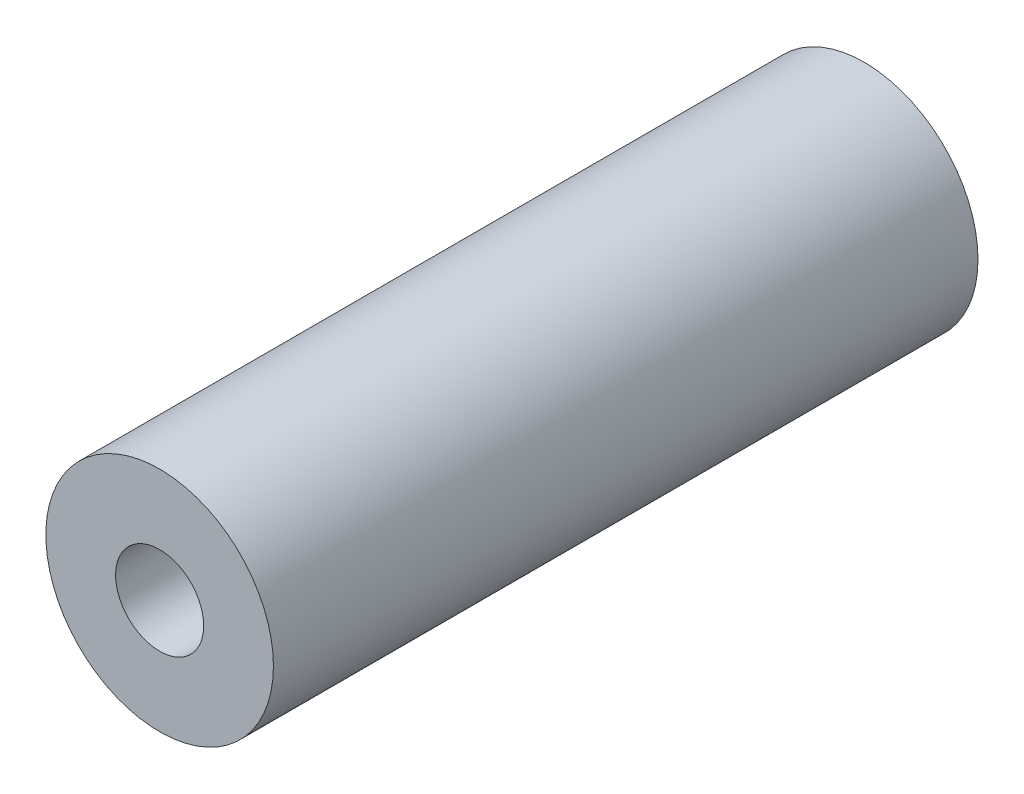
ISO-10303-21;
HEADER;
FILE_DESCRIPTION(('STEP AP214'),'2;1');
FILE_NAME('part.step','',(''),(''),'','','');
FILE_SCHEMA(('AUTOMOTIVE_DESIGN { 1 0 10303 214 1 1 1 1 }'));
ENDSEC;
DATA;
#1=APPLICATION_CONTEXT('core data for automotive mechanical design processes');
#2=APPLICATION_PROTOCOL_DEFINITION('international standard','automotive_design',2000,#1);
#3=PRODUCT_CONTEXT('',#1,'mechanical');
#4=PRODUCT('Part','Part','',(#3));
#5=PRODUCT_RELATED_PRODUCT_CATEGORY('part','',(#4));
#6=PRODUCT_DEFINITION_FORMATION('','',#4);
#7=PRODUCT_DEFINITION_CONTEXT('part definition',#1,'design');
#8=PRODUCT_DEFINITION('design','',#6,#7);
#9=PRODUCT_DEFINITION_SHAPE('','',#8);
#10=(LENGTH_UNIT() NAMED_UNIT(*) SI_UNIT(.MILLI.,.METRE.));
#11=(NAMED_UNIT(*) PLANE_ANGLE_UNIT() SI_UNIT($,.RADIAN.));
#12=(NAMED_UNIT(*) SI_UNIT($,.STERADIAN.) SOLID_ANGLE_UNIT());
#13=UNCERTAINTY_MEASURE_WITH_UNIT(LENGTH_MEASURE(1.E-05),#10,'distance_accuracy_value','');
#14=(GEOMETRIC_REPRESENTATION_CONTEXT(3) GLOBAL_UNCERTAINTY_ASSIGNED_CONTEXT((#13)) GLOBAL_UNIT_ASSIGNED_CONTEXT((#10,
#11,#12)) REPRESENTATION_CONTEXT('',''));
#15=CARTESIAN_POINT('',(0.,0.,0.));
#16=DIRECTION('',(0.,0.,1.));
#17=DIRECTION('',(1.,0.,0.));
#18=AXIS2_PLACEMENT_3D('',#15,#16,#17);
#19=CARTESIAN_POINT('',(-492.127121378298,1432.78731013692,0.));
#20=DIRECTION('',(0.,0.,1.));
#21=DIRECTION('',(1.,0.,0.));
#22=AXIS2_PLACEMENT_3D('',#19,#20,#21);
#23=PLANE('',#22);
#24=CARTESIAN_POINT('',(-492.127121378298,1432.78731013692,0.));
#25=DIRECTION('',(0.,0.,1.));
#26=DIRECTION('',(1.,0.,0.));
#27=AXIS2_PLACEMENT_3D('',#24,#25,#26);
#28=CIRCLE('',#27,16.4084);
#29=CARTESIAN_POINT('',(-475.718721378298,1432.78731013692,0.));
#30=VERTEX_POINT('',#29);
#31=EDGE_CURVE('E53',#30,#30,#28,.T.);
#32=ORIENTED_EDGE('',*,*,#31,.F.);
#33=EDGE_LOOP('',(#32));
#34=FACE_BOUND('',#33,.T.);
#35=CARTESIAN_POINT('',(-492.127121378298,1432.78731013692,0.));
#36=DIRECTION('',(0.,0.,1.));
#37=DIRECTION('',(1.,0.,0.));
#38=AXIS2_PLACEMENT_3D('',#35,#36,#37);
#39=CIRCLE('',#38,6.35000000000008);
#40=CARTESIAN_POINT('',(-485.777121378298,1432.78731013692,0.));
#41=VERTEX_POINT('',#40);
#42=EDGE_CURVE('E66',#41,#41,#39,.T.);
#43=ORIENTED_EDGE('',*,*,#42,.T.);
#44=EDGE_LOOP('',(#43));
#45=FACE_BOUND('',#44,.T.);
#46=ADVANCED_FACE('F46',(#34,#45),#23,.F.);
#47=CARTESIAN_POINT('',(-492.127121378298,2028.05100619533,101.599999999999));
#48=DIRECTION('',(0.,0.,1.));
#49=DIRECTION('',(1.,0.,0.));
#50=AXIS2_PLACEMENT_3D('',#47,#48,#49);
#51=PLANE('',#50);
#52=CARTESIAN_POINT('',(-492.127121378298,1432.78731013692,101.599999999999));
#53=DIRECTION('',(0.,0.,1.));
#54=DIRECTION('',(1.,0.,0.));
#55=AXIS2_PLACEMENT_3D('',#52,#53,#54);
#56=CIRCLE('',#55,16.4084);
#57=CARTESIAN_POINT('',(-475.718721378298,1432.78731013692,101.599999999999));
#58=VERTEX_POINT('',#57);
#59=EDGE_CURVE('E12',#58,#58,#56,.T.);
#60=ORIENTED_EDGE('',*,*,#59,.T.);
#61=EDGE_LOOP('',(#60));
#62=FACE_BOUND('',#61,.T.);
#63=CARTESIAN_POINT('',(-492.127121378298,1432.78731013692,101.599999999999));
#64=DIRECTION('',(0.,0.,1.));
#65=DIRECTION('',(1.,0.,0.));
#66=AXIS2_PLACEMENT_3D('',#63,#64,#65);
#67=CIRCLE('',#66,6.35000000000008);
#68=CARTESIAN_POINT('',(-485.777121378298,1432.78731013692,101.599999999999));
#69=VERTEX_POINT('',#68);
#70=EDGE_CURVE('E61',#69,#69,#67,.T.);
#71=ORIENTED_EDGE('',*,*,#70,.F.);
#72=EDGE_LOOP('',(#71));
#73=FACE_BOUND('',#72,.T.);
#74=ADVANCED_FACE('F48',(#62,#73),#51,.T.);
#75=CARTESIAN_POINT('',(-492.127121378298,1432.78731013692,148.009963633685));
#76=DIRECTION('',(0.,0.,-1.));
#77=DIRECTION('',(-1.,0.,0.));
#78=AXIS2_PLACEMENT_3D('',#75,#76,#77);
#79=CYLINDRICAL_SURFACE('',#78,16.4084);
#80=ORIENTED_EDGE('',*,*,#31,.T.);
#81=EDGE_LOOP('',(#80));
#82=FACE_BOUND('',#81,.T.);
#83=ORIENTED_EDGE('',*,*,#59,.F.);
#84=EDGE_LOOP('',(#83));
#85=FACE_BOUND('',#84,.T.);
#86=ADVANCED_FACE('F85',(#82,#85),#79,.T.);
#87=CARTESIAN_POINT('',(-492.127121378298,1445.38571013692,91.4399999999993));
#88=DIRECTION('',(0.,0.,-1.));
#89=DIRECTION('',(-1.,0.,0.));
#90=AXIS2_PLACEMENT_3D('',#87,#88,#89);
#91=PLANE('',#90);
#92=CARTESIAN_POINT('',(-492.127121378298,1432.78731013692,91.4399999999992));
#93=DIRECTION('',(0.,0.,1.));
#94=DIRECTION('',(1.,0.,0.));
#95=AXIS2_PLACEMENT_3D('',#92,#93,#94);
#96=CIRCLE('',#95,6.35000000000008);
#97=CARTESIAN_POINT('',(-485.777121378298,1432.78731013692,91.4399999999992));
#98=VERTEX_POINT('',#97);
#99=EDGE_CURVE('E57',#98,#98,#96,.T.);
#100=ORIENTED_EDGE('',*,*,#99,.T.);
#101=EDGE_LOOP('',(#100));
#102=FACE_BOUND('',#101,.T.);
#103=CARTESIAN_POINT('',(-492.127121378298,1432.78731013692,91.4399999999994));
#104=DIRECTION('',(0.,0.,1.));
#105=DIRECTION('',(1.,0.,0.));
#106=AXIS2_PLACEMENT_3D('',#103,#104,#105);
#107=CIRCLE('',#106,12.5983999999999);
#108=CARTESIAN_POINT('',(-479.528721378298,1432.78731013692,91.4399999999994));
#109=VERTEX_POINT('',#108);
#110=EDGE_CURVE('E75',#109,#109,#107,.T.);
#111=ORIENTED_EDGE('',*,*,#110,.F.);
#112=EDGE_LOOP('',(#111));
#113=FACE_BOUND('',#112,.T.);
#114=ADVANCED_FACE('F82',(#102,#113),#91,.T.);
#115=CARTESIAN_POINT('',(-492.127121378298,1432.78731013692,101.599999999999));
#116=DIRECTION('',(0.,0.,1.));
#117=DIRECTION('',(1.,0.,0.));
#118=AXIS2_PLACEMENT_3D('',#115,#116,#117);
#119=CYLINDRICAL_SURFACE('',#118,6.35000000000008);
#120=ORIENTED_EDGE('',*,*,#70,.T.);
#121=EDGE_LOOP('',(#120));
#122=FACE_BOUND('',#121,.T.);
#123=ORIENTED_EDGE('',*,*,#99,.F.);
#124=EDGE_LOOP('',(#123));
#125=FACE_BOUND('',#124,.T.);
#126=ADVANCED_FACE('F84',(#122,#125),#119,.F.);
#127=CARTESIAN_POINT('',(-492.127121378298,1432.78731013692,101.599999999999));
#128=DIRECTION('',(0.,0.,1.));
#129=DIRECTION('',(1.,0.,0.));
#130=AXIS2_PLACEMENT_3D('',#127,#128,#129);
#131=CYLINDRICAL_SURFACE('',#130,6.35000000000008);
#132=CARTESIAN_POINT('',(-492.127121378298,1432.78731013692,10.16));
#133=DIRECTION('',(0.,0.,1.));
#134=DIRECTION('',(1.,0.,0.));
#135=AXIS2_PLACEMENT_3D('',#132,#133,#134);
#136=CIRCLE('',#135,6.35000000000008);
#137=CARTESIAN_POINT('',(-485.777121378298,1432.78731013692,10.16));
#138=VERTEX_POINT('',#137);
#139=EDGE_CURVE('E69',#138,#138,#136,.T.);
#140=ORIENTED_EDGE('',*,*,#139,.T.);
#141=EDGE_LOOP('',(#140));
#142=FACE_BOUND('',#141,.T.);
#143=ORIENTED_EDGE('',*,*,#42,.F.);
#144=EDGE_LOOP('',(#143));
#145=FACE_BOUND('',#144,.T.);
#146=ADVANCED_FACE('F92',(#142,#145),#131,.F.);
#147=CARTESIAN_POINT('',(-492.127121378298,1445.38571013692,10.16));
#148=DIRECTION('',(0.,0.,1.));
#149=DIRECTION('',(1.,0.,0.));
#150=AXIS2_PLACEMENT_3D('',#147,#148,#149);
#151=PLANE('',#150);
#152=CARTESIAN_POINT('',(-492.127121378298,1432.78731013692,10.16));
#153=DIRECTION('',(0.,0.,1.));
#154=DIRECTION('',(1.,0.,0.));
#155=AXIS2_PLACEMENT_3D('',#152,#153,#154);
#156=CIRCLE('',#155,12.5983999999999);
#157=CARTESIAN_POINT('',(-479.528721378298,1432.78731013692,10.16));
#158=VERTEX_POINT('',#157);
#159=EDGE_CURVE('E72',#158,#158,#156,.T.);
#160=ORIENTED_EDGE('',*,*,#159,.T.);
#161=EDGE_LOOP('',(#160));
#162=FACE_BOUND('',#161,.T.);
#163=ORIENTED_EDGE('',*,*,#139,.F.);
#164=EDGE_LOOP('',(#163));
#165=FACE_BOUND('',#164,.T.);
#166=ADVANCED_FACE('F105',(#162,#165),#151,.T.);
#167=CARTESIAN_POINT('',(-492.127121378298,1432.78731013692,101.599999999999));
#168=DIRECTION('',(0.,0.,1.));
#169=DIRECTION('',(1.,0.,0.));
#170=AXIS2_PLACEMENT_3D('',#167,#168,#169);
#171=CYLINDRICAL_SURFACE('',#170,12.5983999999999);
#172=ORIENTED_EDGE('',*,*,#110,.T.);
#173=EDGE_LOOP('',(#172));
#174=FACE_BOUND('',#173,.T.);
#175=ORIENTED_EDGE('',*,*,#159,.F.);
#176=EDGE_LOOP('',(#175));
#177=FACE_BOUND('',#176,.T.);
#178=ADVANCED_FACE('F79',(#174,#177),#171,.F.);
#179=CLOSED_SHELL('',(#46,#74,#86,#114,#126,#146,#166,#178));
#180=MANIFOLD_SOLID_BREP('B2',#179);
#181=ADVANCED_BREP_SHAPE_REPRESENTATION('',(#18,#180),#14);
#182=SHAPE_DEFINITION_REPRESENTATION(#9,#181);
ENDSEC;
END-ISO-10303-21;
